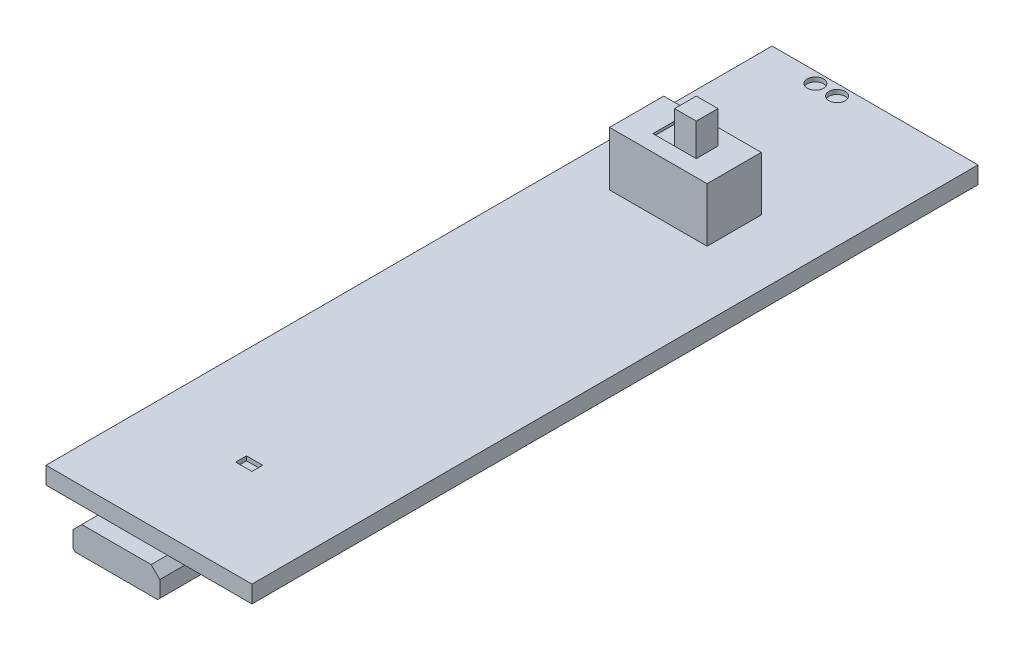
ISO-10303-21;
HEADER;
FILE_DESCRIPTION(('STEP AP214'),'2;1');
FILE_NAME('part.step','',(''),(''),'','','');
FILE_SCHEMA(('AUTOMOTIVE_DESIGN { 1 0 10303 214 1 1 1 1 }'));
ENDSEC;
DATA;
#1=APPLICATION_CONTEXT('core data for automotive mechanical design processes');
#2=APPLICATION_PROTOCOL_DEFINITION('international standard','automotive_design',2000,#1);
#3=PRODUCT_CONTEXT('',#1,'mechanical');
#4=PRODUCT('Part','Part','',(#3));
#5=PRODUCT_RELATED_PRODUCT_CATEGORY('part','',(#4));
#6=PRODUCT_DEFINITION_FORMATION('','',#4);
#7=PRODUCT_DEFINITION_CONTEXT('part definition',#1,'design');
#8=PRODUCT_DEFINITION('design','',#6,#7);
#9=PRODUCT_DEFINITION_SHAPE('','',#8);
#10=(LENGTH_UNIT() NAMED_UNIT(*) SI_UNIT(.MILLI.,.METRE.));
#11=(NAMED_UNIT(*) PLANE_ANGLE_UNIT() SI_UNIT($,.RADIAN.));
#12=(NAMED_UNIT(*) SI_UNIT($,.STERADIAN.) SOLID_ANGLE_UNIT());
#13=UNCERTAINTY_MEASURE_WITH_UNIT(LENGTH_MEASURE(1.E-05),#10,'distance_accuracy_value','');
#14=(GEOMETRIC_REPRESENTATION_CONTEXT(3) GLOBAL_UNCERTAINTY_ASSIGNED_CONTEXT((#13)) GLOBAL_UNIT_ASSIGNED_CONTEXT((#10,
#11,#12)) REPRESENTATION_CONTEXT('',''));
#15=CARTESIAN_POINT('',(0.,0.,0.));
#16=DIRECTION('',(0.,0.,1.));
#17=DIRECTION('',(1.,0.,0.));
#18=AXIS2_PLACEMENT_3D('',#15,#16,#17);
#19=CARTESIAN_POINT('',(-5.5,-0.79375,29.));
#20=DIRECTION('',(-1.,0.,0.));
#21=DIRECTION('',(0.,0.,1.));
#22=AXIS2_PLACEMENT_3D('',#19,#20,#21);
#23=PLANE('',#22);
#24=DIRECTION('',(0.,-1.,0.));
#25=VECTOR('',#24,1.);
#26=CARTESIAN_POINT('',(-5.5,-0.79375,29.));
#27=LINE('',#26,#25);
#28=CARTESIAN_POINT('',(-5.5,-1.59375,29.));
#29=VERTEX_POINT('',#28);
#30=CARTESIAN_POINT('',(-5.5,-3.09375,29.));
#31=VERTEX_POINT('',#30);
#32=EDGE_CURVE('E176',#29,#31,#27,.T.);
#33=ORIENTED_EDGE('',*,*,#32,.T.);
#34=DIRECTION('',(0.,0.,1.));
#35=VECTOR('',#34,1.);
#36=CARTESIAN_POINT('',(-5.5,-3.09375,29.));
#37=LINE('',#36,#35);
#38=CARTESIAN_POINT('',(-5.5,-3.09375,35.));
#39=VERTEX_POINT('',#38);
#40=EDGE_CURVE('E12',#31,#39,#37,.T.);
#41=ORIENTED_EDGE('',*,*,#40,.T.);
#42=DIRECTION('',(0.,-1.,0.));
#43=VECTOR('',#42,1.);
#44=CARTESIAN_POINT('',(-5.5,-0.79375,35.));
#45=LINE('',#44,#43);
#46=CARTESIAN_POINT('',(-5.5,-1.59375,35.));
#47=VERTEX_POINT('',#46);
#48=EDGE_CURVE('E280',#47,#39,#45,.T.);
#49=ORIENTED_EDGE('',*,*,#48,.F.);
#50=DIRECTION('',(0.,0.,-1.));
#51=VECTOR('',#50,1.);
#52=CARTESIAN_POINT('',(-5.5,-1.59375,29.));
#53=LINE('',#52,#51);
#54=EDGE_CURVE('E155',#47,#29,#53,.T.);
#55=ORIENTED_EDGE('',*,*,#54,.T.);
#56=EDGE_LOOP('',(#33,#41,#49,#55));
#57=FACE_BOUND('',#56,.T.);
#58=ADVANCED_FACE('F49',(#57),#23,.T.);
#59=CARTESIAN_POINT('',(-5.5,-0.79375,29.));
#60=DIRECTION('',(0.,1.,0.));
#61=DIRECTION('',(0.,0.,1.));
#62=AXIS2_PLACEMENT_3D('',#59,#60,#61);
#63=PLANE('',#62);
#64=DIRECTION('',(-1.,0.,0.));
#65=VECTOR('',#64,1.);
#66=CARTESIAN_POINT('',(-5.5,-0.79375,35.));
#67=LINE('',#66,#65);
#68=CARTESIAN_POINT('',(1.7,-0.79375,35.));
#69=VERTEX_POINT('',#68);
#70=CARTESIAN_POINT('',(-4.7,-0.79375,35.));
#71=VERTEX_POINT('',#70);
#72=EDGE_CURVE('E125',#69,#71,#67,.T.);
#73=ORIENTED_EDGE('',*,*,#72,.F.);
#74=DIRECTION('',(0.,0.,-1.));
#75=VECTOR('',#74,1.);
#76=CARTESIAN_POINT('',(1.7,-0.79375,29.));
#77=LINE('',#76,#75);
#78=CARTESIAN_POINT('',(1.7,-0.79375,29.));
#79=VERTEX_POINT('',#78);
#80=EDGE_CURVE('E134',#69,#79,#77,.T.);
#81=ORIENTED_EDGE('',*,*,#80,.T.);
#82=DIRECTION('',(-1.,0.,0.));
#83=VECTOR('',#82,1.);
#84=CARTESIAN_POINT('',(-5.5,-0.79375,29.));
#85=LINE('',#84,#83);
#86=CARTESIAN_POINT('',(-4.7,-0.79375,29.));
#87=VERTEX_POINT('',#86);
#88=EDGE_CURVE('E141',#79,#87,#85,.T.);
#89=ORIENTED_EDGE('',*,*,#88,.T.);
#90=DIRECTION('',(0.,0.,1.));
#91=VECTOR('',#90,1.);
#92=CARTESIAN_POINT('',(-4.7,-0.79375,29.));
#93=LINE('',#92,#91);
#94=EDGE_CURVE('E135',#87,#71,#93,.T.);
#95=ORIENTED_EDGE('',*,*,#94,.T.);
#96=EDGE_LOOP('',(#73,#81,#89,#95));
#97=FACE_BOUND('',#96,.T.);
#98=ADVANCED_FACE('F190',(#97),#63,.T.);
#99=CARTESIAN_POINT('',(2.5,-0.79375,29.));
#100=DIRECTION('',(1.,0.,0.));
#101=DIRECTION('',(0.,1.,0.));
#102=AXIS2_PLACEMENT_3D('',#99,#100,#101);
#103=PLANE('',#102);
#104=DIRECTION('',(0.,1.,0.));
#105=VECTOR('',#104,1.);
#106=CARTESIAN_POINT('',(2.5,-0.79375,35.));
#107=LINE('',#106,#105);
#108=CARTESIAN_POINT('',(2.5,-3.09375,35.));
#109=VERTEX_POINT('',#108);
#110=CARTESIAN_POINT('',(2.5,-1.59375,35.));
#111=VERTEX_POINT('',#110);
#112=EDGE_CURVE('E116',#109,#111,#107,.T.);
#113=ORIENTED_EDGE('',*,*,#112,.F.);
#114=DIRECTION('',(0.,0.,-1.));
#115=VECTOR('',#114,1.);
#116=CARTESIAN_POINT('',(2.5,-3.09375,29.));
#117=LINE('',#116,#115);
#118=CARTESIAN_POINT('',(2.5,-3.09375,29.));
#119=VERTEX_POINT('',#118);
#120=EDGE_CURVE('E73',#109,#119,#117,.T.);
#121=ORIENTED_EDGE('',*,*,#120,.T.);
#122=DIRECTION('',(0.,1.,0.));
#123=VECTOR('',#122,1.);
#124=CARTESIAN_POINT('',(2.5,-0.79375,29.));
#125=LINE('',#124,#123);
#126=CARTESIAN_POINT('',(2.5,-1.59375,29.));
#127=VERTEX_POINT('',#126);
#128=EDGE_CURVE('E139',#119,#127,#125,.T.);
#129=ORIENTED_EDGE('',*,*,#128,.T.);
#130=DIRECTION('',(0.,0.,1.));
#131=VECTOR('',#130,1.);
#132=CARTESIAN_POINT('',(2.5,-1.59375,29.));
#133=LINE('',#132,#131);
#134=EDGE_CURVE('E133',#127,#111,#133,.T.);
#135=ORIENTED_EDGE('',*,*,#134,.T.);
#136=EDGE_LOOP('',(#113,#121,#129,#135));
#137=FACE_BOUND('',#136,.T.);
#138=ADVANCED_FACE('F138',(#137),#103,.T.);
#139=CARTESIAN_POINT('',(-5.5,-3.29375,29.));
#140=DIRECTION('',(0.,-1.,0.));
#141=DIRECTION('',(0.,0.,-1.));
#142=AXIS2_PLACEMENT_3D('',#139,#140,#141);
#143=PLANE('',#142);
#144=DIRECTION('',(1.,0.,0.));
#145=VECTOR('',#144,1.);
#146=CARTESIAN_POINT('',(-5.5,-3.29375,29.));
#147=LINE('',#146,#145);
#148=CARTESIAN_POINT('',(-5.3,-3.29375,29.));
#149=VERTEX_POINT('',#148);
#150=CARTESIAN_POINT('',(2.3,-3.29375,29.));
#151=VERTEX_POINT('',#150);
#152=EDGE_CURVE('E169',#149,#151,#147,.T.);
#153=ORIENTED_EDGE('',*,*,#152,.T.);
#154=DIRECTION('',(0.,0.,1.));
#155=VECTOR('',#154,1.);
#156=CARTESIAN_POINT('',(2.3,-3.29375,29.));
#157=LINE('',#156,#155);
#158=CARTESIAN_POINT('',(2.3,-3.29375,35.));
#159=VERTEX_POINT('',#158);
#160=EDGE_CURVE('E159',#151,#159,#157,.T.);
#161=ORIENTED_EDGE('',*,*,#160,.T.);
#162=DIRECTION('',(1.,0.,0.));
#163=VECTOR('',#162,1.);
#164=CARTESIAN_POINT('',(-5.5,-3.29375,35.));
#165=LINE('',#164,#163);
#166=CARTESIAN_POINT('',(-5.3,-3.29375,35.));
#167=VERTEX_POINT('',#166);
#168=EDGE_CURVE('E126',#167,#159,#165,.T.);
#169=ORIENTED_EDGE('',*,*,#168,.F.);
#170=DIRECTION('',(0.,0.,-1.));
#171=VECTOR('',#170,1.);
#172=CARTESIAN_POINT('',(-5.3,-3.29375,29.));
#173=LINE('',#172,#171);
#174=EDGE_CURVE('E157',#167,#149,#173,.T.);
#175=ORIENTED_EDGE('',*,*,#174,.T.);
#176=EDGE_LOOP('',(#153,#161,#169,#175));
#177=FACE_BOUND('',#176,.T.);
#178=ADVANCED_FACE('F173',(#177),#143,.T.);
#179=CARTESIAN_POINT('',(0.,0.,29.));
#180=DIRECTION('',(0.,0.,1.));
#181=DIRECTION('',(1.,0.,0.));
#182=AXIS2_PLACEMENT_3D('',#179,#180,#181);
#183=PLANE('',#182);
#184=ORIENTED_EDGE('',*,*,#128,.F.);
#185=DIRECTION('',(0.707106781186546,0.707106781186549,0.));
#186=VECTOR('',#185,1.);
#187=CARTESIAN_POINT('',(2.3,-3.29375,29.));
#188=LINE('',#187,#186);
#189=EDGE_CURVE('E58',#119,#151,#188,.F.);
#190=ORIENTED_EDGE('',*,*,#189,.T.);
#191=ORIENTED_EDGE('',*,*,#152,.F.);
#192=DIRECTION('',(0.707106781186549,-0.707106781186546,0.));
#193=VECTOR('',#192,1.);
#194=CARTESIAN_POINT('',(-5.5,-3.09375,29.));
#195=LINE('',#194,#193);
#196=EDGE_CURVE('E65',#149,#31,#195,.F.);
#197=ORIENTED_EDGE('',*,*,#196,.T.);
#198=ORIENTED_EDGE('',*,*,#32,.F.);
#199=DIRECTION('',(-0.707106781186547,-0.707106781186548,0.));
#200=VECTOR('',#199,1.);
#201=CARTESIAN_POINT('',(-4.7,-0.79375,29.));
#202=LINE('',#201,#200);
#203=EDGE_CURVE('E151',#29,#87,#202,.F.);
#204=ORIENTED_EDGE('',*,*,#203,.T.);
#205=ORIENTED_EDGE('',*,*,#88,.F.);
#206=DIRECTION('',(-0.707106781186549,0.707106781186546,0.));
#207=VECTOR('',#206,1.);
#208=CARTESIAN_POINT('',(2.5,-1.59375,29.));
#209=LINE('',#208,#207);
#210=EDGE_CURVE('E153',#79,#127,#209,.F.);
#211=ORIENTED_EDGE('',*,*,#210,.T.);
#212=EDGE_LOOP('',(#184,#190,#191,#197,#198,#204,#205,#211));
#213=FACE_BOUND('',#212,.T.);
#214=ADVANCED_FACE('F168',(#213),#183,.F.);
#215=CARTESIAN_POINT('',(0.,0.,35.));
#216=DIRECTION('',(0.,0.,1.));
#217=DIRECTION('',(1.,0.,0.));
#218=AXIS2_PLACEMENT_3D('',#215,#216,#217);
#219=PLANE('',#218);
#220=ORIENTED_EDGE('',*,*,#168,.T.);
#221=DIRECTION('',(-0.707106781186546,-0.707106781186549,0.));
#222=VECTOR('',#221,1.);
#223=CARTESIAN_POINT('',(2.79687500000001,-2.79687499999999,35.));
#224=LINE('',#223,#222);
#225=EDGE_CURVE('E123',#159,#109,#224,.F.);
#226=ORIENTED_EDGE('',*,*,#225,.T.);
#227=ORIENTED_EDGE('',*,*,#112,.T.);
#228=DIRECTION('',(0.707106781186549,-0.707106781186546,0.));
#229=VECTOR('',#228,1.);
#230=CARTESIAN_POINT('',(0.453124999999997,0.453124999999999,35.));
#231=LINE('',#230,#229);
#232=EDGE_CURVE('E121',#111,#69,#231,.F.);
#233=ORIENTED_EDGE('',*,*,#232,.T.);
#234=ORIENTED_EDGE('',*,*,#72,.T.);
#235=DIRECTION('',(0.707106781186547,0.707106781186548,0.));
#236=VECTOR('',#235,1.);
#237=CARTESIAN_POINT('',(-1.953125,1.953125,35.));
#238=LINE('',#237,#236);
#239=EDGE_CURVE('E136',#71,#47,#238,.F.);
#240=ORIENTED_EDGE('',*,*,#239,.T.);
#241=ORIENTED_EDGE('',*,*,#48,.T.);
#242=DIRECTION('',(-0.707106781186549,0.707106781186546,0.));
#243=VECTOR('',#242,1.);
#244=CARTESIAN_POINT('',(-4.29687499999999,-4.29687500000001,35.));
#245=LINE('',#244,#243);
#246=EDGE_CURVE('E162',#39,#167,#245,.F.);
#247=ORIENTED_EDGE('',*,*,#246,.T.);
#248=EDGE_LOOP('',(#220,#226,#227,#233,#234,#240,#241,#247));
#249=FACE_BOUND('',#248,.T.);
#250=ADVANCED_FACE('F119',(#249),#219,.T.);
#251=CARTESIAN_POINT('',(2.5,-1.59375,29.));
#252=DIRECTION('',(-0.707106781186546,-0.707106781186549,0.));
#253=DIRECTION('',(0.,0.,1.));
#254=AXIS2_PLACEMENT_3D('',#251,#252,#253);
#255=PLANE('',#254);
#256=ORIENTED_EDGE('',*,*,#210,.F.);
#257=ORIENTED_EDGE('',*,*,#80,.F.);
#258=ORIENTED_EDGE('',*,*,#232,.F.);
#259=ORIENTED_EDGE('',*,*,#134,.F.);
#260=EDGE_LOOP('',(#256,#257,#258,#259));
#261=FACE_BOUND('',#260,.T.);
#262=ADVANCED_FACE('F132',(#261),#255,.F.);
#263=CARTESIAN_POINT('',(-4.7,-0.79375,29.));
#264=DIRECTION('',(0.707106781186548,-0.707106781186547,0.));
#265=DIRECTION('',(0.,0.,1.));
#266=AXIS2_PLACEMENT_3D('',#263,#264,#265);
#267=PLANE('',#266);
#268=ORIENTED_EDGE('',*,*,#203,.F.);
#269=ORIENTED_EDGE('',*,*,#54,.F.);
#270=ORIENTED_EDGE('',*,*,#239,.F.);
#271=ORIENTED_EDGE('',*,*,#94,.F.);
#272=EDGE_LOOP('',(#268,#269,#270,#271));
#273=FACE_BOUND('',#272,.T.);
#274=ADVANCED_FACE('F180',(#273),#267,.F.);
#275=CARTESIAN_POINT('',(2.3,-3.29375,29.));
#276=DIRECTION('',(-0.707106781186549,0.707106781186546,0.));
#277=DIRECTION('',(0.,0.,1.));
#278=AXIS2_PLACEMENT_3D('',#275,#276,#277);
#279=PLANE('',#278);
#280=ORIENTED_EDGE('',*,*,#189,.F.);
#281=ORIENTED_EDGE('',*,*,#120,.F.);
#282=ORIENTED_EDGE('',*,*,#225,.F.);
#283=ORIENTED_EDGE('',*,*,#160,.F.);
#284=EDGE_LOOP('',(#280,#281,#282,#283));
#285=FACE_BOUND('',#284,.T.);
#286=ADVANCED_FACE('F178',(#285),#279,.F.);
#287=CARTESIAN_POINT('',(-5.5,-3.09375,29.));
#288=DIRECTION('',(0.707106781186546,0.707106781186549,0.));
#289=DIRECTION('',(0.,0.,1.));
#290=AXIS2_PLACEMENT_3D('',#287,#288,#289);
#291=PLANE('',#290);
#292=ORIENTED_EDGE('',*,*,#196,.F.);
#293=ORIENTED_EDGE('',*,*,#174,.F.);
#294=ORIENTED_EDGE('',*,*,#246,.F.);
#295=ORIENTED_EDGE('',*,*,#40,.F.);
#296=EDGE_LOOP('',(#292,#293,#294,#295));
#297=FACE_BOUND('',#296,.T.);
#298=ADVANCED_FACE('F52',(#297),#291,.F.);
#299=CLOSED_SHELL('',(#58,#98,#138,#178,#214,#250,#262,#274,#286,#298));
#300=MANIFOLD_SOLID_BREP('B2',#299);
#301=CARTESIAN_POINT('',(0.,0.79375,0.));
#302=DIRECTION('',(0.,1.,0.));
#303=DIRECTION('',(0.,0.,1.));
#304=AXIS2_PLACEMENT_3D('',#301,#302,#303);
#305=PLANE('',#304);
#306=CARTESIAN_POINT('',(-4.5,0.79375,-32.5));
#307=DIRECTION('',(0.,1.,0.));
#308=DIRECTION('',(0.,0.,1.));
#309=AXIS2_PLACEMENT_3D('',#306,#307,#308);
#310=CIRCLE('',#309,0.75);
#311=CARTESIAN_POINT('',(-4.5,0.79375,-31.75));
#312=VERTEX_POINT('',#311);
#313=EDGE_CURVE('E883',#312,#312,#310,.T.);
#314=ORIENTED_EDGE('',*,*,#313,.F.);
#315=EDGE_LOOP('',(#314));
#316=FACE_BOUND('',#315,.T.);
#317=CARTESIAN_POINT('',(-2.50000000000001,0.79375,-32.5));
#318=DIRECTION('',(0.,1.,0.));
#319=DIRECTION('',(0.,0.,1.));
#320=AXIS2_PLACEMENT_3D('',#317,#318,#319);
#321=CIRCLE('',#320,0.75);
#322=CARTESIAN_POINT('',(-2.50000000000001,0.79375,-31.75));
#323=VERTEX_POINT('',#322);
#324=EDGE_CURVE('E447',#323,#323,#321,.T.);
#325=ORIENTED_EDGE('',*,*,#324,.F.);
#326=EDGE_LOOP('',(#325));
#327=FACE_BOUND('',#326,.T.);
#328=DIRECTION('',(0.,0.,1.));
#329=VECTOR('',#328,1.);
#330=CARTESIAN_POINT('',(-1.,0.79375,23.5));
#331=LINE('',#330,#329);
#332=CARTESIAN_POINT('',(-1.,0.79375,23.5));
#333=VERTEX_POINT('',#332);
#334=CARTESIAN_POINT('',(-1.,0.79375,24.5));
#335=VERTEX_POINT('',#334);
#336=EDGE_CURVE('E304',#333,#335,#331,.T.);
#337=ORIENTED_EDGE('',*,*,#336,.F.);
#338=DIRECTION('',(-1.,0.,0.));
#339=VECTOR('',#338,1.);
#340=CARTESIAN_POINT('',(-1.,0.79375,23.5));
#341=LINE('',#340,#339);
#342=CARTESIAN_POINT('',(0.499999999999995,0.79375,23.5));
#343=VERTEX_POINT('',#342);
#344=EDGE_CURVE('E441',#343,#333,#341,.T.);
#345=ORIENTED_EDGE('',*,*,#344,.F.);
#346=DIRECTION('',(0.,0.,-1.));
#347=VECTOR('',#346,1.);
#348=CARTESIAN_POINT('',(0.499999999999995,0.79375,23.5));
#349=LINE('',#348,#347);
#350=CARTESIAN_POINT('',(0.499999999999995,0.79375,24.5));
#351=VERTEX_POINT('',#350);
#352=EDGE_CURVE('E444',#351,#343,#349,.T.);
#353=ORIENTED_EDGE('',*,*,#352,.F.);
#354=DIRECTION('',(1.,0.,0.));
#355=VECTOR('',#354,1.);
#356=CARTESIAN_POINT('',(-1.,0.79375,24.5));
#357=LINE('',#356,#355);
#358=EDGE_CURVE('E453',#335,#351,#357,.T.);
#359=ORIENTED_EDGE('',*,*,#358,.F.);
#360=EDGE_LOOP('',(#337,#345,#353,#359));
#361=FACE_BOUND('',#360,.T.);
#362=DIRECTION('',(0.,0.,-1.));
#363=VECTOR('',#362,1.);
#364=CARTESIAN_POINT('',(9.49999999999999,0.79375,-33.5));
#365=LINE('',#364,#363);
#366=CARTESIAN_POINT('',(9.5,0.79375,33.5));
#367=VERTEX_POINT('',#366);
#368=CARTESIAN_POINT('',(9.49999999999999,0.79375,-33.5));
#369=VERTEX_POINT('',#368);
#370=EDGE_CURVE('E543',#367,#369,#365,.T.);
#371=ORIENTED_EDGE('',*,*,#370,.T.);
#372=DIRECTION('',(-1.,0.,0.));
#373=VECTOR('',#372,1.);
#374=CARTESIAN_POINT('',(-9.50000000000001,0.79375,-33.5));
#375=LINE('',#374,#373);
#376=CARTESIAN_POINT('',(-9.50000000000001,0.79375,-33.5));
#377=VERTEX_POINT('',#376);
#378=EDGE_CURVE('E546',#369,#377,#375,.T.);
#379=ORIENTED_EDGE('',*,*,#378,.T.);
#380=DIRECTION('',(0.,0.,1.));
#381=VECTOR('',#380,1.);
#382=CARTESIAN_POINT('',(-9.50000000000001,0.79375,-33.5));
#383=LINE('',#382,#381);
#384=CARTESIAN_POINT('',(-9.5,0.79375,33.5));
#385=VERTEX_POINT('',#384);
#386=EDGE_CURVE('E549',#377,#385,#383,.T.);
#387=ORIENTED_EDGE('',*,*,#386,.T.);
#388=DIRECTION('',(1.,0.,0.));
#389=VECTOR('',#388,1.);
#390=CARTESIAN_POINT('',(-9.5,0.79375,33.5));
#391=LINE('',#390,#389);
#392=EDGE_CURVE('E551',#385,#367,#391,.T.);
#393=ORIENTED_EDGE('',*,*,#392,.T.);
#394=EDGE_LOOP('',(#371,#379,#387,#393));
#395=FACE_BOUND('',#394,.T.);
#396=DIRECTION('',(1.,0.,0.));
#397=VECTOR('',#396,1.);
#398=CARTESIAN_POINT('',(-5.5,0.79375,-14.5));
#399=LINE('',#398,#397);
#400=CARTESIAN_POINT('',(-5.5,0.79375,-14.5));
#401=VERTEX_POINT('',#400);
#402=CARTESIAN_POINT('',(3.5,0.79375,-14.5));
#403=VERTEX_POINT('',#402);
#404=EDGE_CURVE('E527',#401,#403,#399,.T.);
#405=ORIENTED_EDGE('',*,*,#404,.F.);
#406=DIRECTION('',(0.,0.,1.));
#407=VECTOR('',#406,1.);
#408=CARTESIAN_POINT('',(-5.5,0.79375,-19.5));
#409=LINE('',#408,#407);
#410=CARTESIAN_POINT('',(-5.5,0.79375,-19.5));
#411=VERTEX_POINT('',#410);
#412=EDGE_CURVE('E511',#411,#401,#409,.T.);
#413=ORIENTED_EDGE('',*,*,#412,.F.);
#414=DIRECTION('',(-1.,0.,0.));
#415=VECTOR('',#414,1.);
#416=CARTESIAN_POINT('',(-5.5,0.79375,-19.5));
#417=LINE('',#416,#415);
#418=CARTESIAN_POINT('',(3.5,0.79375,-19.5));
#419=VERTEX_POINT('',#418);
#420=EDGE_CURVE('E518',#419,#411,#417,.T.);
#421=ORIENTED_EDGE('',*,*,#420,.F.);
#422=DIRECTION('',(0.,0.,-1.));
#423=VECTOR('',#422,1.);
#424=CARTESIAN_POINT('',(3.5,0.79375,-19.5));
#425=LINE('',#424,#423);
#426=EDGE_CURVE('E529',#403,#419,#425,.T.);
#427=ORIENTED_EDGE('',*,*,#426,.F.);
#428=EDGE_LOOP('',(#405,#413,#421,#427));
#429=FACE_BOUND('',#428,.T.);
#430=ADVANCED_FACE('F289',(#316,#327,#361,#395,#429),#305,.T.);
#431=CARTESIAN_POINT('',(9.49999999999999,0.79375,-33.5));
#432=DIRECTION('',(-1.,0.,0.));
#433=DIRECTION('',(0.,0.,1.));
#434=AXIS2_PLACEMENT_3D('',#431,#432,#433);
#435=PLANE('',#434);
#436=DIRECTION('',(0.,0.,-1.));
#437=VECTOR('',#436,1.);
#438=CARTESIAN_POINT('',(9.49999999999999,-0.79375,-33.5));
#439=LINE('',#438,#437);
#440=CARTESIAN_POINT('',(9.5,-0.79375,33.5));
#441=VERTEX_POINT('',#440);
#442=CARTESIAN_POINT('',(9.49999999999999,-0.79375,-33.5));
#443=VERTEX_POINT('',#442);
#444=EDGE_CURVE('E542',#441,#443,#439,.T.);
#445=ORIENTED_EDGE('',*,*,#444,.T.);
#446=DIRECTION('',(0.,-1.,0.));
#447=VECTOR('',#446,1.);
#448=CARTESIAN_POINT('',(9.49999999999999,0.79375,-33.5));
#449=LINE('',#448,#447);
#450=EDGE_CURVE('E47',#369,#443,#449,.T.);
#451=ORIENTED_EDGE('',*,*,#450,.F.);
#452=ORIENTED_EDGE('',*,*,#370,.F.);
#453=DIRECTION('',(0.,-1.,0.));
#454=VECTOR('',#453,1.);
#455=CARTESIAN_POINT('',(9.5,0.79375,33.5));
#456=LINE('',#455,#454);
#457=EDGE_CURVE('E553',#367,#441,#456,.T.);
#458=ORIENTED_EDGE('',*,*,#457,.T.);
#459=EDGE_LOOP('',(#445,#451,#452,#458));
#460=FACE_BOUND('',#459,.T.);
#461=ADVANCED_FACE('F291',(#460),#435,.F.);
#462=CARTESIAN_POINT('',(-9.50000000000001,0.79375,-33.5));
#463=DIRECTION('',(0.,0.,1.));
#464=DIRECTION('',(1.,0.,0.));
#465=AXIS2_PLACEMENT_3D('',#462,#463,#464);
#466=PLANE('',#465);
#467=DIRECTION('',(-1.,0.,0.));
#468=VECTOR('',#467,1.);
#469=CARTESIAN_POINT('',(-9.50000000000001,-0.79375,-33.5));
#470=LINE('',#469,#468);
#471=CARTESIAN_POINT('',(-9.50000000000001,-0.79375,-33.5));
#472=VERTEX_POINT('',#471);
#473=EDGE_CURVE('E556',#443,#472,#470,.T.);
#474=ORIENTED_EDGE('',*,*,#473,.T.);
#475=DIRECTION('',(0.,-1.,0.));
#476=VECTOR('',#475,1.);
#477=CARTESIAN_POINT('',(-9.50000000000001,0.79375,-33.5));
#478=LINE('',#477,#476);
#479=EDGE_CURVE('E297',#377,#472,#478,.T.);
#480=ORIENTED_EDGE('',*,*,#479,.F.);
#481=ORIENTED_EDGE('',*,*,#378,.F.);
#482=ORIENTED_EDGE('',*,*,#450,.T.);
#483=EDGE_LOOP('',(#474,#480,#481,#482));
#484=FACE_BOUND('',#483,.T.);
#485=ADVANCED_FACE('F586',(#484),#466,.F.);
#486=CARTESIAN_POINT('',(-9.50000000000001,0.79375,-33.5));
#487=DIRECTION('',(1.,0.,0.));
#488=DIRECTION('',(0.,0.,-1.));
#489=AXIS2_PLACEMENT_3D('',#486,#487,#488);
#490=PLANE('',#489);
#491=DIRECTION('',(0.,0.,1.));
#492=VECTOR('',#491,1.);
#493=CARTESIAN_POINT('',(-9.50000000000001,-0.79375,-33.5));
#494=LINE('',#493,#492);
#495=CARTESIAN_POINT('',(-9.5,-0.79375,33.5));
#496=VERTEX_POINT('',#495);
#497=EDGE_CURVE('E558',#472,#496,#494,.T.);
#498=ORIENTED_EDGE('',*,*,#497,.T.);
#499=DIRECTION('',(0.,-1.,0.));
#500=VECTOR('',#499,1.);
#501=CARTESIAN_POINT('',(-9.5,0.79375,33.5));
#502=LINE('',#501,#500);
#503=EDGE_CURVE('E563',#385,#496,#502,.T.);
#504=ORIENTED_EDGE('',*,*,#503,.F.);
#505=ORIENTED_EDGE('',*,*,#386,.F.);
#506=ORIENTED_EDGE('',*,*,#479,.T.);
#507=EDGE_LOOP('',(#498,#504,#505,#506));
#508=FACE_BOUND('',#507,.T.);
#509=ADVANCED_FACE('F570',(#508),#490,.F.);
#510=CARTESIAN_POINT('',(-9.5,0.79375,33.5));
#511=DIRECTION('',(0.,0.,-1.));
#512=DIRECTION('',(-1.,0.,0.));
#513=AXIS2_PLACEMENT_3D('',#510,#511,#512);
#514=PLANE('',#513);
#515=DIRECTION('',(1.,0.,0.));
#516=VECTOR('',#515,1.);
#517=CARTESIAN_POINT('',(-9.5,-0.79375,33.5));
#518=LINE('',#517,#516);
#519=EDGE_CURVE('E547',#496,#441,#518,.T.);
#520=ORIENTED_EDGE('',*,*,#519,.T.);
#521=ORIENTED_EDGE('',*,*,#457,.F.);
#522=ORIENTED_EDGE('',*,*,#392,.F.);
#523=ORIENTED_EDGE('',*,*,#503,.T.);
#524=EDGE_LOOP('',(#520,#521,#522,#523));
#525=FACE_BOUND('',#524,.T.);
#526=ADVANCED_FACE('F579',(#525),#514,.F.);
#527=CARTESIAN_POINT('',(0.,-0.79375,0.));
#528=DIRECTION('',(0.,1.,0.));
#529=DIRECTION('',(0.,0.,1.));
#530=AXIS2_PLACEMENT_3D('',#527,#528,#529);
#531=PLANE('',#530);
#532=ORIENTED_EDGE('',*,*,#444,.F.);
#533=ORIENTED_EDGE('',*,*,#519,.F.);
#534=ORIENTED_EDGE('',*,*,#497,.F.);
#535=ORIENTED_EDGE('',*,*,#473,.F.);
#536=EDGE_LOOP('',(#532,#533,#534,#535));
#537=FACE_BOUND('',#536,.T.);
#538=ADVANCED_FACE('F576',(#537),#531,.F.);
#539=CARTESIAN_POINT('',(-5.5,5.79375,-19.5));
#540=DIRECTION('',(1.,0.,0.));
#541=DIRECTION('',(0.,0.,-1.));
#542=AXIS2_PLACEMENT_3D('',#539,#540,#541);
#543=PLANE('',#542);
#544=ORIENTED_EDGE('',*,*,#412,.T.);
#545=DIRECTION('',(0.,-1.,0.));
#546=VECTOR('',#545,1.);
#547=CARTESIAN_POINT('',(-5.5,5.79375,-14.5));
#548=LINE('',#547,#546);
#549=CARTESIAN_POINT('',(-5.5,5.79375,-14.5));
#550=VERTEX_POINT('',#549);
#551=EDGE_CURVE('E540',#550,#401,#548,.T.);
#552=ORIENTED_EDGE('',*,*,#551,.F.);
#553=DIRECTION('',(0.,0.,1.));
#554=VECTOR('',#553,1.);
#555=CARTESIAN_POINT('',(-5.5,5.79375,-19.5));
#556=LINE('',#555,#554);
#557=CARTESIAN_POINT('',(-5.5,5.79375,-19.5));
#558=VERTEX_POINT('',#557);
#559=EDGE_CURVE('E514',#558,#550,#556,.T.);
#560=ORIENTED_EDGE('',*,*,#559,.F.);
#561=DIRECTION('',(0.,-1.,0.));
#562=VECTOR('',#561,1.);
#563=CARTESIAN_POINT('',(-5.5,5.79375,-19.5));
#564=LINE('',#563,#562);
#565=EDGE_CURVE('E524',#558,#411,#564,.T.);
#566=ORIENTED_EDGE('',*,*,#565,.T.);
#567=EDGE_LOOP('',(#544,#552,#560,#566));
#568=FACE_BOUND('',#567,.T.);
#569=ADVANCED_FACE('F602',(#568),#543,.F.);
#570=CARTESIAN_POINT('',(-5.5,5.79375,-14.5));
#571=DIRECTION('',(0.,0.,-1.));
#572=DIRECTION('',(-1.,0.,0.));
#573=AXIS2_PLACEMENT_3D('',#570,#571,#572);
#574=PLANE('',#573);
#575=ORIENTED_EDGE('',*,*,#404,.T.);
#576=DIRECTION('',(0.,-1.,0.));
#577=VECTOR('',#576,1.);
#578=CARTESIAN_POINT('',(3.5,5.79375,-14.5));
#579=LINE('',#578,#577);
#580=CARTESIAN_POINT('',(3.5,5.79375,-14.5));
#581=VERTEX_POINT('',#580);
#582=EDGE_CURVE('E537',#581,#403,#579,.T.);
#583=ORIENTED_EDGE('',*,*,#582,.F.);
#584=DIRECTION('',(1.,0.,0.));
#585=VECTOR('',#584,1.);
#586=CARTESIAN_POINT('',(-5.5,5.79375,-14.5));
#587=LINE('',#586,#585);
#588=EDGE_CURVE('E517',#550,#581,#587,.T.);
#589=ORIENTED_EDGE('',*,*,#588,.F.);
#590=ORIENTED_EDGE('',*,*,#551,.T.);
#591=EDGE_LOOP('',(#575,#583,#589,#590));
#592=FACE_BOUND('',#591,.T.);
#593=ADVANCED_FACE('F622',(#592),#574,.F.);
#594=CARTESIAN_POINT('',(3.5,5.79375,-19.5));
#595=DIRECTION('',(-1.,0.,0.));
#596=DIRECTION('',(0.,0.,1.));
#597=AXIS2_PLACEMENT_3D('',#594,#595,#596);
#598=PLANE('',#597);
#599=ORIENTED_EDGE('',*,*,#426,.T.);
#600=DIRECTION('',(0.,-1.,0.));
#601=VECTOR('',#600,1.);
#602=CARTESIAN_POINT('',(3.5,5.79375,-19.5));
#603=LINE('',#602,#601);
#604=CARTESIAN_POINT('',(3.5,5.79375,-19.5));
#605=VERTEX_POINT('',#604);
#606=EDGE_CURVE('E535',#605,#419,#603,.T.);
#607=ORIENTED_EDGE('',*,*,#606,.F.);
#608=DIRECTION('',(0.,0.,-1.));
#609=VECTOR('',#608,1.);
#610=CARTESIAN_POINT('',(3.5,5.79375,-19.5));
#611=LINE('',#610,#609);
#612=EDGE_CURVE('E520',#581,#605,#611,.T.);
#613=ORIENTED_EDGE('',*,*,#612,.F.);
#614=ORIENTED_EDGE('',*,*,#582,.T.);
#615=EDGE_LOOP('',(#599,#607,#613,#614));
#616=FACE_BOUND('',#615,.T.);
#617=ADVANCED_FACE('F629',(#616),#598,.F.);
#618=CARTESIAN_POINT('',(-5.5,5.79375,-19.5));
#619=DIRECTION('',(0.,0.,1.));
#620=DIRECTION('',(1.,0.,0.));
#621=AXIS2_PLACEMENT_3D('',#618,#619,#620);
#622=PLANE('',#621);
#623=ORIENTED_EDGE('',*,*,#420,.T.);
#624=ORIENTED_EDGE('',*,*,#565,.F.);
#625=DIRECTION('',(-1.,0.,0.));
#626=VECTOR('',#625,1.);
#627=CARTESIAN_POINT('',(-5.5,5.79375,-19.5));
#628=LINE('',#627,#626);
#629=EDGE_CURVE('E522',#605,#558,#628,.T.);
#630=ORIENTED_EDGE('',*,*,#629,.F.);
#631=ORIENTED_EDGE('',*,*,#606,.T.);
#632=EDGE_LOOP('',(#623,#624,#630,#631));
#633=FACE_BOUND('',#632,.T.);
#634=ADVANCED_FACE('F636',(#633),#622,.F.);
#635=CARTESIAN_POINT('',(0.,5.79375,0.));
#636=DIRECTION('',(0.,1.,0.));
#637=DIRECTION('',(0.,0.,1.));
#638=AXIS2_PLACEMENT_3D('',#635,#636,#637);
#639=PLANE('',#638);
#640=DIRECTION('',(-1.,0.,0.));
#641=VECTOR('',#640,1.);
#642=CARTESIAN_POINT('',(0.,5.79375,-18.));
#643=LINE('',#642,#641);
#644=CARTESIAN_POINT('',(1.,5.79375,-18.));
#645=VERTEX_POINT('',#644);
#646=CARTESIAN_POINT('',(-0.999999999999998,5.79375,-18.));
#647=VERTEX_POINT('',#646);
#648=EDGE_CURVE('E497',#645,#647,#643,.T.);
#649=ORIENTED_EDGE('',*,*,#648,.F.);
#650=DIRECTION('',(0.,0.,1.));
#651=VECTOR('',#650,1.);
#652=CARTESIAN_POINT('',(1.,5.79375,0.));
#653=LINE('',#652,#651);
#654=CARTESIAN_POINT('',(1.,5.79375,-16.));
#655=VERTEX_POINT('',#654);
#656=EDGE_CURVE('E491',#645,#655,#653,.T.);
#657=ORIENTED_EDGE('',*,*,#656,.T.);
#658=DIRECTION('',(-1.,0.,0.));
#659=VECTOR('',#658,1.);
#660=CARTESIAN_POINT('',(0.,5.79375,-16.));
#661=LINE('',#660,#659);
#662=CARTESIAN_POINT('',(-0.999999999999998,5.79375,-16.));
#663=VERTEX_POINT('',#662);
#664=EDGE_CURVE('E504',#655,#663,#661,.T.);
#665=ORIENTED_EDGE('',*,*,#664,.T.);
#666=CARTESIAN_POINT('',(-3.,5.79375,-16.));
#667=VERTEX_POINT('',#666);
#668=EDGE_CURVE('E503',#663,#667,#661,.T.);
#669=ORIENTED_EDGE('',*,*,#668,.T.);
#670=DIRECTION('',(0.,0.,1.));
#671=VECTOR('',#670,1.);
#672=CARTESIAN_POINT('',(-3.,5.79375,0.));
#673=LINE('',#672,#671);
#674=CARTESIAN_POINT('',(-3.,5.79375,-18.));
#675=VERTEX_POINT('',#674);
#676=EDGE_CURVE('E500',#675,#667,#673,.T.);
#677=ORIENTED_EDGE('',*,*,#676,.F.);
#678=EDGE_CURVE('E478',#647,#675,#643,.T.);
#679=ORIENTED_EDGE('',*,*,#678,.F.);
#680=EDGE_LOOP('',(#649,#657,#665,#669,#677,#679));
#681=FACE_BOUND('',#680,.T.);
#682=ORIENTED_EDGE('',*,*,#559,.T.);
#683=ORIENTED_EDGE('',*,*,#588,.T.);
#684=ORIENTED_EDGE('',*,*,#612,.T.);
#685=ORIENTED_EDGE('',*,*,#629,.T.);
#686=EDGE_LOOP('',(#682,#683,#684,#685));
#687=FACE_BOUND('',#686,.T.);
#688=ADVANCED_FACE('F644',(#681,#687),#639,.T.);
#689=CARTESIAN_POINT('',(0.,5.54375,-18.));
#690=DIRECTION('',(0.,0.,-1.));
#691=DIRECTION('',(-1.,0.,0.));
#692=AXIS2_PLACEMENT_3D('',#689,#690,#691);
#693=PLANE('',#692);
#694=DIRECTION('',(-1.,0.,0.));
#695=VECTOR('',#694,1.);
#696=CARTESIAN_POINT('',(0.,5.54375,-18.));
#697=LINE('',#696,#695);
#698=CARTESIAN_POINT('',(-0.999999999999998,5.54375,-18.));
#699=VERTEX_POINT('',#698);
#700=CARTESIAN_POINT('',(-3.,5.54375,-18.));
#701=VERTEX_POINT('',#700);
#702=EDGE_CURVE('E488',#699,#701,#697,.T.);
#703=ORIENTED_EDGE('',*,*,#702,.F.);
#704=DIRECTION('',(0.,1.,0.));
#705=VECTOR('',#704,1.);
#706=CARTESIAN_POINT('',(-0.999999999999998,2.71532287525381,-18.));
#707=LINE('',#706,#705);
#708=EDGE_CURVE('E312',#699,#647,#707,.T.);
#709=ORIENTED_EDGE('',*,*,#708,.T.);
#710=ORIENTED_EDGE('',*,*,#678,.T.);
#711=DIRECTION('',(0.,1.,0.));
#712=VECTOR('',#711,1.);
#713=CARTESIAN_POINT('',(-3.,5.54375,-18.));
#714=LINE('',#713,#712);
#715=EDGE_CURVE('E496',#701,#675,#714,.T.);
#716=ORIENTED_EDGE('',*,*,#715,.F.);
#717=EDGE_LOOP('',(#703,#709,#710,#716));
#718=FACE_BOUND('',#717,.T.);
#719=ADVANCED_FACE('F653',(#718),#693,.F.);
#720=CARTESIAN_POINT('',(0.,5.54375,-16.));
#721=DIRECTION('',(0.,0.,-1.));
#722=DIRECTION('',(-1.,0.,0.));
#723=AXIS2_PLACEMENT_3D('',#720,#721,#722);
#724=PLANE('',#723);
#725=DIRECTION('',(0.,1.,0.));
#726=VECTOR('',#725,1.);
#727=CARTESIAN_POINT('',(-0.999999999999998,2.71532287525381,-16.));
#728=LINE('',#727,#726);
#729=CARTESIAN_POINT('',(-0.999999999999998,5.54375,-16.));
#730=VERTEX_POINT('',#729);
#731=EDGE_CURVE('E481',#730,#663,#728,.T.);
#732=ORIENTED_EDGE('',*,*,#731,.F.);
#733=DIRECTION('',(-1.,0.,0.));
#734=VECTOR('',#733,1.);
#735=CARTESIAN_POINT('',(0.,5.54375,-16.));
#736=LINE('',#735,#734);
#737=CARTESIAN_POINT('',(-3.,5.54375,-16.));
#738=VERTEX_POINT('',#737);
#739=EDGE_CURVE('E494',#730,#738,#736,.T.);
#740=ORIENTED_EDGE('',*,*,#739,.T.);
#741=DIRECTION('',(0.,1.,0.));
#742=VECTOR('',#741,1.);
#743=CARTESIAN_POINT('',(-3.,5.54375,-16.));
#744=LINE('',#743,#742);
#745=EDGE_CURVE('E508',#738,#667,#744,.T.);
#746=ORIENTED_EDGE('',*,*,#745,.T.);
#747=ORIENTED_EDGE('',*,*,#668,.F.);
#748=EDGE_LOOP('',(#732,#740,#746,#747));
#749=FACE_BOUND('',#748,.T.);
#750=ADVANCED_FACE('F661',(#749),#724,.T.);
#751=CARTESIAN_POINT('',(-3.,5.54375,0.));
#752=DIRECTION('',(-1.,0.,0.));
#753=DIRECTION('',(0.,0.,1.));
#754=AXIS2_PLACEMENT_3D('',#751,#752,#753);
#755=PLANE('',#754);
#756=ORIENTED_EDGE('',*,*,#676,.T.);
#757=ORIENTED_EDGE('',*,*,#745,.F.);
#758=DIRECTION('',(0.,0.,1.));
#759=VECTOR('',#758,1.);
#760=CARTESIAN_POINT('',(-3.,5.54375,0.));
#761=LINE('',#760,#759);
#762=EDGE_CURVE('E490',#701,#738,#761,.T.);
#763=ORIENTED_EDGE('',*,*,#762,.F.);
#764=ORIENTED_EDGE('',*,*,#715,.T.);
#765=EDGE_LOOP('',(#756,#757,#763,#764));
#766=FACE_BOUND('',#765,.T.);
#767=ADVANCED_FACE('F668',(#766),#755,.F.);
#768=CARTESIAN_POINT('',(0.,5.54375,0.));
#769=DIRECTION('',(0.,1.,0.));
#770=DIRECTION('',(0.,0.,1.));
#771=AXIS2_PLACEMENT_3D('',#768,#769,#770);
#772=PLANE('',#771);
#773=DIRECTION('',(0.,0.,-1.));
#774=VECTOR('',#773,1.);
#775=CARTESIAN_POINT('',(-0.999999999999998,5.54375,0.));
#776=LINE('',#775,#774);
#777=EDGE_CURVE('E476',#730,#699,#776,.T.);
#778=ORIENTED_EDGE('',*,*,#777,.T.);
#779=ORIENTED_EDGE('',*,*,#702,.T.);
#780=ORIENTED_EDGE('',*,*,#762,.T.);
#781=ORIENTED_EDGE('',*,*,#739,.F.);
#782=EDGE_LOOP('',(#778,#779,#780,#781));
#783=FACE_BOUND('',#782,.T.);
#784=ADVANCED_FACE('F676',(#783),#772,.T.);
#785=CARTESIAN_POINT('',(0.,2.71532287525381,-18.));
#786=DIRECTION('',(0.,0.,1.));
#787=DIRECTION('',(1.,0.,0.));
#788=AXIS2_PLACEMENT_3D('',#785,#786,#787);
#789=PLANE('',#788);
#790=ORIENTED_EDGE('',*,*,#648,.T.);
#791=CARTESIAN_POINT('',(-0.999999999999998,8.79375,-18.));
#792=VERTEX_POINT('',#791);
#793=EDGE_CURVE('E486',#647,#792,#707,.T.);
#794=ORIENTED_EDGE('',*,*,#793,.T.);
#795=DIRECTION('',(1.,0.,0.));
#796=VECTOR('',#795,1.);
#797=CARTESIAN_POINT('',(0.,8.79375,-18.));
#798=LINE('',#797,#796);
#799=CARTESIAN_POINT('',(1.,8.79375,-18.));
#800=VERTEX_POINT('',#799);
#801=EDGE_CURVE('E465',#792,#800,#798,.T.);
#802=ORIENTED_EDGE('',*,*,#801,.T.);
#803=DIRECTION('',(0.,1.,0.));
#804=VECTOR('',#803,1.);
#805=CARTESIAN_POINT('',(1.,2.71532287525381,-18.));
#806=LINE('',#805,#804);
#807=EDGE_CURVE('E475',#645,#800,#806,.T.);
#808=ORIENTED_EDGE('',*,*,#807,.F.);
#809=EDGE_LOOP('',(#790,#794,#802,#808));
#810=FACE_BOUND('',#809,.T.);
#811=ADVANCED_FACE('F683',(#810),#789,.F.);
#812=CARTESIAN_POINT('',(-0.999999999999998,2.71532287525381,0.));
#813=DIRECTION('',(-1.,0.,0.));
#814=DIRECTION('',(0.,0.,1.));
#815=AXIS2_PLACEMENT_3D('',#812,#813,#814);
#816=PLANE('',#815);
#817=ORIENTED_EDGE('',*,*,#777,.F.);
#818=ORIENTED_EDGE('',*,*,#731,.T.);
#819=CARTESIAN_POINT('',(-0.999999999999998,8.79375,-16.));
#820=VERTEX_POINT('',#819);
#821=EDGE_CURVE('E484',#663,#820,#728,.T.);
#822=ORIENTED_EDGE('',*,*,#821,.T.);
#823=DIRECTION('',(0.,0.,1.));
#824=VECTOR('',#823,1.);
#825=CARTESIAN_POINT('',(-0.999999999999998,8.79375,0.));
#826=LINE('',#825,#824);
#827=EDGE_CURVE('E469',#792,#820,#826,.T.);
#828=ORIENTED_EDGE('',*,*,#827,.F.);
#829=ORIENTED_EDGE('',*,*,#793,.F.);
#830=ORIENTED_EDGE('',*,*,#708,.F.);
#831=EDGE_LOOP('',(#817,#818,#822,#828,#829,#830));
#832=FACE_BOUND('',#831,.T.);
#833=ADVANCED_FACE('F691',(#832),#816,.T.);
#834=CARTESIAN_POINT('',(0.,2.71532287525381,-16.));
#835=DIRECTION('',(0.,0.,1.));
#836=DIRECTION('',(1.,0.,0.));
#837=AXIS2_PLACEMENT_3D('',#834,#835,#836);
#838=PLANE('',#837);
#839=ORIENTED_EDGE('',*,*,#821,.F.);
#840=ORIENTED_EDGE('',*,*,#664,.F.);
#841=DIRECTION('',(0.,1.,0.));
#842=VECTOR('',#841,1.);
#843=CARTESIAN_POINT('',(1.,2.71532287525381,-16.));
#844=LINE('',#843,#842);
#845=CARTESIAN_POINT('',(1.,8.79375,-16.));
#846=VERTEX_POINT('',#845);
#847=EDGE_CURVE('E479',#655,#846,#844,.T.);
#848=ORIENTED_EDGE('',*,*,#847,.T.);
#849=DIRECTION('',(1.,0.,0.));
#850=VECTOR('',#849,1.);
#851=CARTESIAN_POINT('',(0.,8.79375,-16.));
#852=LINE('',#851,#850);
#853=EDGE_CURVE('E472',#820,#846,#852,.T.);
#854=ORIENTED_EDGE('',*,*,#853,.F.);
#855=EDGE_LOOP('',(#839,#840,#848,#854));
#856=FACE_BOUND('',#855,.T.);
#857=ADVANCED_FACE('F699',(#856),#838,.T.);
#858=CARTESIAN_POINT('',(1.,2.71532287525381,0.));
#859=DIRECTION('',(-1.,0.,0.));
#860=DIRECTION('',(0.,0.,1.));
#861=AXIS2_PLACEMENT_3D('',#858,#859,#860);
#862=PLANE('',#861);
#863=ORIENTED_EDGE('',*,*,#656,.F.);
#864=ORIENTED_EDGE('',*,*,#807,.T.);
#865=DIRECTION('',(0.,0.,1.));
#866=VECTOR('',#865,1.);
#867=CARTESIAN_POINT('',(1.,8.79375,0.));
#868=LINE('',#867,#866);
#869=EDGE_CURVE('E462',#800,#846,#868,.T.);
#870=ORIENTED_EDGE('',*,*,#869,.T.);
#871=ORIENTED_EDGE('',*,*,#847,.F.);
#872=EDGE_LOOP('',(#863,#864,#870,#871));
#873=FACE_BOUND('',#872,.T.);
#874=ADVANCED_FACE('F707',(#873),#862,.F.);
#875=CARTESIAN_POINT('',(0.,8.79375,0.));
#876=DIRECTION('',(0.,1.,0.));
#877=DIRECTION('',(0.,0.,1.));
#878=AXIS2_PLACEMENT_3D('',#875,#876,#877);
#879=PLANE('',#878);
#880=ORIENTED_EDGE('',*,*,#869,.F.);
#881=ORIENTED_EDGE('',*,*,#801,.F.);
#882=ORIENTED_EDGE('',*,*,#827,.T.);
#883=ORIENTED_EDGE('',*,*,#853,.T.);
#884=EDGE_LOOP('',(#880,#881,#882,#883));
#885=FACE_BOUND('',#884,.T.);
#886=ADVANCED_FACE('F715',(#885),#879,.T.);
#887=CARTESIAN_POINT('',(-1.,0.396875,23.5));
#888=DIRECTION('',(-1.,0.,0.));
#889=DIRECTION('',(0.,0.,1.));
#890=AXIS2_PLACEMENT_3D('',#887,#888,#889);
#891=PLANE('',#890);
#892=ORIENTED_EDGE('',*,*,#336,.T.);
#893=DIRECTION('',(0.,1.,0.));
#894=VECTOR('',#893,1.);
#895=CARTESIAN_POINT('',(-1.,0.396875,24.5));
#896=LINE('',#895,#894);
#897=CARTESIAN_POINT('',(-1.,0.396875,24.5));
#898=VERTEX_POINT('',#897);
#899=EDGE_CURVE('E419',#898,#335,#896,.T.);
#900=ORIENTED_EDGE('',*,*,#899,.F.);
#901=DIRECTION('',(0.,0.,1.));
#902=VECTOR('',#901,1.);
#903=CARTESIAN_POINT('',(-1.,0.396875,23.5));
#904=LINE('',#903,#902);
#905=CARTESIAN_POINT('',(-1.,0.396875,23.5));
#906=VERTEX_POINT('',#905);
#907=EDGE_CURVE('E423',#906,#898,#904,.T.);
#908=ORIENTED_EDGE('',*,*,#907,.F.);
#909=DIRECTION('',(0.,1.,0.));
#910=VECTOR('',#909,1.);
#911=CARTESIAN_POINT('',(-1.,0.396875,23.5));
#912=LINE('',#911,#910);
#913=EDGE_CURVE('E457',#906,#333,#912,.T.);
#914=ORIENTED_EDGE('',*,*,#913,.T.);
#915=EDGE_LOOP('',(#892,#900,#908,#914));
#916=FACE_BOUND('',#915,.T.);
#917=ADVANCED_FACE('F421',(#916),#891,.F.);
#918=CARTESIAN_POINT('',(-1.,0.396875,23.5));
#919=DIRECTION('',(0.,0.,-1.));
#920=DIRECTION('',(-1.,0.,0.));
#921=AXIS2_PLACEMENT_3D('',#918,#919,#920);
#922=PLANE('',#921);
#923=ORIENTED_EDGE('',*,*,#344,.T.);
#924=ORIENTED_EDGE('',*,*,#913,.F.);
#925=DIRECTION('',(-1.,0.,0.));
#926=VECTOR('',#925,1.);
#927=CARTESIAN_POINT('',(-1.,0.396875,23.5));
#928=LINE('',#927,#926);
#929=CARTESIAN_POINT('',(0.499999999999995,0.396875,23.5));
#930=VERTEX_POINT('',#929);
#931=EDGE_CURVE('E429',#930,#906,#928,.T.);
#932=ORIENTED_EDGE('',*,*,#931,.F.);
#933=DIRECTION('',(0.,1.,0.));
#934=VECTOR('',#933,1.);
#935=CARTESIAN_POINT('',(0.499999999999995,0.396875,23.5));
#936=LINE('',#935,#934);
#937=EDGE_CURVE('E459',#930,#343,#936,.T.);
#938=ORIENTED_EDGE('',*,*,#937,.T.);
#939=EDGE_LOOP('',(#923,#924,#932,#938));
#940=FACE_BOUND('',#939,.T.);
#941=ADVANCED_FACE('F730',(#940),#922,.F.);
#942=CARTESIAN_POINT('',(0.499999999999995,0.396875,23.5));
#943=DIRECTION('',(1.,0.,0.));
#944=DIRECTION('',(0.,0.,-1.));
#945=AXIS2_PLACEMENT_3D('',#942,#943,#944);
#946=PLANE('',#945);
#947=ORIENTED_EDGE('',*,*,#352,.T.);
#948=ORIENTED_EDGE('',*,*,#937,.F.);
#949=DIRECTION('',(0.,0.,-1.));
#950=VECTOR('',#949,1.);
#951=CARTESIAN_POINT('',(0.499999999999995,0.396875,23.5));
#952=LINE('',#951,#950);
#953=CARTESIAN_POINT('',(0.499999999999995,0.396875,24.5));
#954=VERTEX_POINT('',#953);
#955=EDGE_CURVE('E437',#954,#930,#952,.T.);
#956=ORIENTED_EDGE('',*,*,#955,.F.);
#957=DIRECTION('',(0.,1.,0.));
#958=VECTOR('',#957,1.);
#959=CARTESIAN_POINT('',(0.499999999999995,0.396875,24.5));
#960=LINE('',#959,#958);
#961=EDGE_CURVE('E428',#954,#351,#960,.T.);
#962=ORIENTED_EDGE('',*,*,#961,.T.);
#963=EDGE_LOOP('',(#947,#948,#956,#962));
#964=FACE_BOUND('',#963,.T.);
#965=ADVANCED_FACE('F737',(#964),#946,.F.);
#966=CARTESIAN_POINT('',(-1.,0.396875,24.5));
#967=DIRECTION('',(0.,0.,1.));
#968=DIRECTION('',(1.,0.,0.));
#969=AXIS2_PLACEMENT_3D('',#966,#967,#968);
#970=PLANE('',#969);
#971=ORIENTED_EDGE('',*,*,#358,.T.);
#972=ORIENTED_EDGE('',*,*,#961,.F.);
#973=DIRECTION('',(1.,0.,0.));
#974=VECTOR('',#973,1.);
#975=CARTESIAN_POINT('',(-1.,0.396875,24.5));
#976=LINE('',#975,#974);
#977=EDGE_CURVE('E432',#898,#954,#976,.T.);
#978=ORIENTED_EDGE('',*,*,#977,.F.);
#979=ORIENTED_EDGE('',*,*,#899,.T.);
#980=EDGE_LOOP('',(#971,#972,#978,#979));
#981=FACE_BOUND('',#980,.T.);
#982=ADVANCED_FACE('F433',(#981),#970,.F.);
#983=CARTESIAN_POINT('',(0.,0.396875,0.));
#984=DIRECTION('',(0.,1.,0.));
#985=DIRECTION('',(0.,0.,1.));
#986=AXIS2_PLACEMENT_3D('',#983,#984,#985);
#987=PLANE('',#986);
#988=ORIENTED_EDGE('',*,*,#907,.T.);
#989=ORIENTED_EDGE('',*,*,#977,.T.);
#990=ORIENTED_EDGE('',*,*,#955,.T.);
#991=ORIENTED_EDGE('',*,*,#931,.T.);
#992=EDGE_LOOP('',(#988,#989,#990,#991));
#993=FACE_BOUND('',#992,.T.);
#994=ADVANCED_FACE('F439',(#993),#987,.T.);
#995=CARTESIAN_POINT('',(-2.50000000000001,0.396875,-32.5));
#996=DIRECTION('',(0.,1.,0.));
#997=DIRECTION('',(0.,0.,1.));
#998=AXIS2_PLACEMENT_3D('',#995,#996,#997);
#999=CYLINDRICAL_SURFACE('',#998,0.75);
#1000=CARTESIAN_POINT('',(-2.50000000000001,0.396875,-32.5));
#1001=DIRECTION('',(0.,1.,0.));
#1002=DIRECTION('',(0.,0.,1.));
#1003=AXIS2_PLACEMENT_3D('',#1000,#1001,#1002);
#1004=CIRCLE('',#1003,0.75);
#1005=CARTESIAN_POINT('',(-2.50000000000001,0.396875,-31.75));
#1006=VERTEX_POINT('',#1005);
#1007=EDGE_CURVE('E886',#1006,#1006,#1004,.T.);
#1008=ORIENTED_EDGE('',*,*,#1007,.F.);
#1009=EDGE_LOOP('',(#1008));
#1010=FACE_BOUND('',#1009,.T.);
#1011=ORIENTED_EDGE('',*,*,#324,.T.);
#1012=EDGE_LOOP('',(#1011));
#1013=FACE_BOUND('',#1012,.T.);
#1014=ADVANCED_FACE('F758',(#1010,#1013),#999,.F.);
#1015=CARTESIAN_POINT('',(-2.50000000000001,0.396875,-32.5));
#1016=DIRECTION('',(0.,1.,0.));
#1017=DIRECTION('',(0.,0.,1.));
#1018=AXIS2_PLACEMENT_3D('',#1015,#1016,#1017);
#1019=PLANE('',#1018);
#1020=ORIENTED_EDGE('',*,*,#1007,.T.);
#1021=EDGE_LOOP('',(#1020));
#1022=FACE_BOUND('',#1021,.T.);
#1023=ADVANCED_FACE('F765',(#1022),#1019,.T.);
#1024=CARTESIAN_POINT('',(-4.5,0.396875,-32.5));
#1025=DIRECTION('',(0.,1.,0.));
#1026=DIRECTION('',(0.,0.,1.));
#1027=AXIS2_PLACEMENT_3D('',#1024,#1025,#1026);
#1028=CYLINDRICAL_SURFACE('',#1027,0.75);
#1029=CARTESIAN_POINT('',(-4.5,0.396875,-32.5));
#1030=DIRECTION('',(0.,1.,0.));
#1031=DIRECTION('',(0.,0.,1.));
#1032=AXIS2_PLACEMENT_3D('',#1029,#1030,#1031);
#1033=CIRCLE('',#1032,0.75);
#1034=CARTESIAN_POINT('',(-4.5,0.396875,-31.75));
#1035=VERTEX_POINT('',#1034);
#1036=EDGE_CURVE('E466',#1035,#1035,#1033,.T.);
#1037=ORIENTED_EDGE('',*,*,#1036,.F.);
#1038=EDGE_LOOP('',(#1037));
#1039=FACE_BOUND('',#1038,.T.);
#1040=ORIENTED_EDGE('',*,*,#313,.T.);
#1041=EDGE_LOOP('',(#1040));
#1042=FACE_BOUND('',#1041,.T.);
#1043=ADVANCED_FACE('F773',(#1039,#1042),#1028,.F.);
#1044=CARTESIAN_POINT('',(-4.5,0.396875,-32.5));
#1045=DIRECTION('',(0.,1.,0.));
#1046=DIRECTION('',(0.,0.,1.));
#1047=AXIS2_PLACEMENT_3D('',#1044,#1045,#1046);
#1048=PLANE('',#1047);
#1049=ORIENTED_EDGE('',*,*,#1036,.T.);
#1050=EDGE_LOOP('',(#1049));
#1051=FACE_BOUND('',#1050,.T.);
#1052=ADVANCED_FACE('F781',(#1051),#1048,.T.);
#1053=CLOSED_SHELL('',(#430,#461,#485,#509,#526,#538,#569,#593,#617,#634,#688,#719,#750,#767,
#784,#811,#833,#857,#874,#886,#917,#941,#965,#982,#994,#1014,#1023,#1043,#1052));
#1054=MANIFOLD_SOLID_BREP('B6',#1053);
#1055=ADVANCED_BREP_SHAPE_REPRESENTATION('',(#18,#300,#1054),#14);
#1056=SHAPE_DEFINITION_REPRESENTATION(#9,#1055);
ENDSEC;
END-ISO-10303-21;
